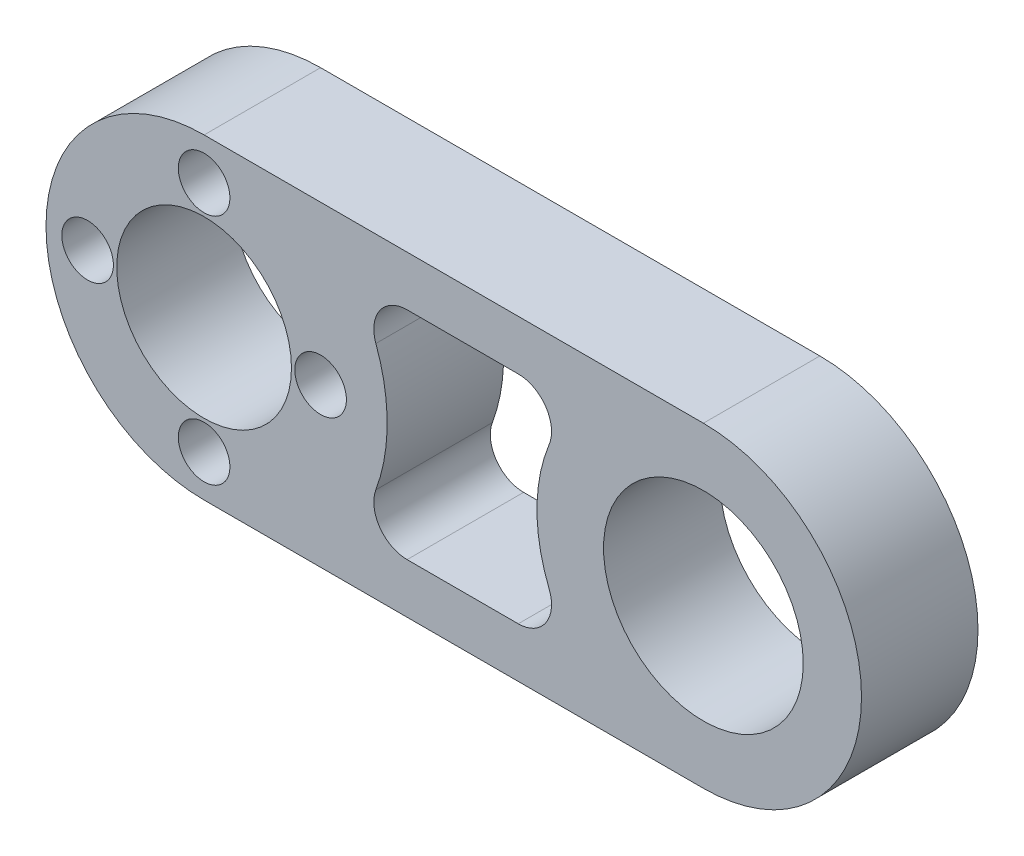
ISO-10303-21;
HEADER;
FILE_DESCRIPTION(('STEP AP214'),'2;1');
FILE_NAME('part.step','',(''),(''),'','','');
FILE_SCHEMA(('AUTOMOTIVE_DESIGN { 1 0 10303 214 1 1 1 1 }'));
ENDSEC;
DATA;
#1=APPLICATION_CONTEXT('core data for automotive mechanical design processes');
#2=APPLICATION_PROTOCOL_DEFINITION('international standard','automotive_design',2000,#1);
#3=PRODUCT_CONTEXT('',#1,'mechanical');
#4=PRODUCT('Part','Part','',(#3));
#5=PRODUCT_RELATED_PRODUCT_CATEGORY('part','',(#4));
#6=PRODUCT_DEFINITION_FORMATION('','',#4);
#7=PRODUCT_DEFINITION_CONTEXT('part definition',#1,'design');
#8=PRODUCT_DEFINITION('design','',#6,#7);
#9=PRODUCT_DEFINITION_SHAPE('','',#8);
#10=(LENGTH_UNIT() NAMED_UNIT(*) SI_UNIT(.MILLI.,.METRE.));
#11=(NAMED_UNIT(*) PLANE_ANGLE_UNIT() SI_UNIT($,.RADIAN.));
#12=(NAMED_UNIT(*) SI_UNIT($,.STERADIAN.) SOLID_ANGLE_UNIT());
#13=UNCERTAINTY_MEASURE_WITH_UNIT(LENGTH_MEASURE(1.E-05),#10,'distance_accuracy_value','');
#14=(GEOMETRIC_REPRESENTATION_CONTEXT(3) GLOBAL_UNCERTAINTY_ASSIGNED_CONTEXT((#13)) GLOBAL_UNIT_ASSIGNED_CONTEXT((#10,
#11,#12)) REPRESENTATION_CONTEXT('',''));
#15=CARTESIAN_POINT('',(0.,0.,0.));
#16=DIRECTION('',(0.,0.,1.));
#17=DIRECTION('',(1.,0.,0.));
#18=AXIS2_PLACEMENT_3D('',#15,#16,#17);
#19=CARTESIAN_POINT('',(0.,0.,7.));
#20=DIRECTION('',(0.,0.,1.));
#21=DIRECTION('',(1.,0.,0.));
#22=AXIS2_PLACEMENT_3D('',#19,#20,#21);
#23=PLANE('',#22);
#24=CARTESIAN_POINT('',(0.,7.,7.));
#25=DIRECTION('',(0.,0.,1.));
#26=DIRECTION('',(1.,0.,0.));
#27=AXIS2_PLACEMENT_3D('',#24,#25,#26);
#28=CIRCLE('',#27,1.55);
#29=CARTESIAN_POINT('',(1.55,7.,7.));
#30=VERTEX_POINT('',#29);
#31=EDGE_CURVE('E225',#30,#30,#28,.T.);
#32=ORIENTED_EDGE('',*,*,#31,.F.);
#33=EDGE_LOOP('',(#32));
#34=FACE_BOUND('',#33,.T.);
#35=CARTESIAN_POINT('',(0.,-7.,7.));
#36=DIRECTION('',(0.,0.,1.));
#37=DIRECTION('',(1.,0.,0.));
#38=AXIS2_PLACEMENT_3D('',#35,#36,#37);
#39=CIRCLE('',#38,1.55);
#40=CARTESIAN_POINT('',(1.55,-7.,7.));
#41=VERTEX_POINT('',#40);
#42=EDGE_CURVE('E237',#41,#41,#39,.T.);
#43=ORIENTED_EDGE('',*,*,#42,.F.);
#44=EDGE_LOOP('',(#43));
#45=FACE_BOUND('',#44,.T.);
#46=CARTESIAN_POINT('',(0.,0.,7.));
#47=DIRECTION('',(0.,0.,1.));
#48=DIRECTION('',(1.,0.,0.));
#49=AXIS2_PLACEMENT_3D('',#46,#47,#48);
#50=CIRCLE('',#49,5.25);
#51=CARTESIAN_POINT('',(5.25,0.,7.));
#52=VERTEX_POINT('',#51);
#53=EDGE_CURVE('E249',#52,#52,#50,.T.);
#54=ORIENTED_EDGE('',*,*,#53,.F.);
#55=EDGE_LOOP('',(#54));
#56=FACE_BOUND('',#55,.T.);
#57=CARTESIAN_POINT('',(0.,0.,7.));
#58=DIRECTION('',(0.,0.,1.));
#59=DIRECTION('',(1.,0.,0.));
#60=AXIS2_PLACEMENT_3D('',#57,#58,#59);
#61=CIRCLE('',#60,9.5);
#62=CARTESIAN_POINT('',(0.,9.5,7.));
#63=VERTEX_POINT('',#62);
#64=CARTESIAN_POINT('',(0.,-9.5,7.));
#65=VERTEX_POINT('',#64);
#66=EDGE_CURVE('E135',#63,#65,#61,.T.);
#67=ORIENTED_EDGE('',*,*,#66,.T.);
#68=DIRECTION('',(1.,0.,0.));
#69=VECTOR('',#68,1.);
#70=CARTESIAN_POINT('',(0.,-9.5,7.));
#71=LINE('',#70,#69);
#72=CARTESIAN_POINT('',(30.,-9.5,7.));
#73=VERTEX_POINT('',#72);
#74=EDGE_CURVE('E124',#65,#73,#71,.T.);
#75=ORIENTED_EDGE('',*,*,#74,.T.);
#76=CARTESIAN_POINT('',(30.,0.,7.));
#77=DIRECTION('',(0.,0.,1.));
#78=DIRECTION('',(1.,0.,0.));
#79=AXIS2_PLACEMENT_3D('',#76,#77,#78);
#80=CIRCLE('',#79,9.5);
#81=CARTESIAN_POINT('',(30.,9.5,7.));
#82=VERTEX_POINT('',#81);
#83=EDGE_CURVE('E134',#73,#82,#80,.T.);
#84=ORIENTED_EDGE('',*,*,#83,.T.);
#85=DIRECTION('',(-1.,0.,0.));
#86=VECTOR('',#85,1.);
#87=CARTESIAN_POINT('',(0.,9.5,7.));
#88=LINE('',#87,#86);
#89=EDGE_CURVE('E140',#82,#63,#88,.T.);
#90=ORIENTED_EDGE('',*,*,#89,.T.);
#91=EDGE_LOOP('',(#67,#75,#84,#90));
#92=FACE_BOUND('',#91,.T.);
#93=CARTESIAN_POINT('',(30.,0.,7.));
#94=DIRECTION('',(0.,0.,1.));
#95=DIRECTION('',(1.,0.,0.));
#96=AXIS2_PLACEMENT_3D('',#93,#94,#95);
#97=CIRCLE('',#96,6.);
#98=CARTESIAN_POINT('',(36.,0.,7.));
#99=VERTEX_POINT('',#98);
#100=EDGE_CURVE('E243',#99,#99,#97,.T.);
#101=ORIENTED_EDGE('',*,*,#100,.F.);
#102=EDGE_LOOP('',(#101));
#103=FACE_BOUND('',#102,.T.);
#104=CARTESIAN_POINT('',(-7.,0.,7.));
#105=DIRECTION('',(0.,0.,1.));
#106=DIRECTION('',(1.,0.,0.));
#107=AXIS2_PLACEMENT_3D('',#104,#105,#106);
#108=CIRCLE('',#107,1.55);
#109=CARTESIAN_POINT('',(-5.45,0.,7.));
#110=VERTEX_POINT('',#109);
#111=EDGE_CURVE('E231',#110,#110,#108,.T.);
#112=ORIENTED_EDGE('',*,*,#111,.F.);
#113=EDGE_LOOP('',(#112));
#114=FACE_BOUND('',#113,.T.);
#115=CARTESIAN_POINT('',(7.,0.,7.));
#116=DIRECTION('',(0.,0.,1.));
#117=DIRECTION('',(1.,0.,0.));
#118=AXIS2_PLACEMENT_3D('',#115,#116,#117);
#119=CIRCLE('',#118,1.55);
#120=CARTESIAN_POINT('',(8.55,0.,7.));
#121=VERTEX_POINT('',#120);
#122=EDGE_CURVE('E209',#121,#121,#119,.T.);
#123=ORIENTED_EDGE('',*,*,#122,.F.);
#124=EDGE_LOOP('',(#123));
#125=FACE_BOUND('',#124,.T.);
#126=DIRECTION('',(-1.,0.,0.));
#127=VECTOR('',#126,1.);
#128=CARTESIAN_POINT('',(22.4006579232147,6.5,7.));
#129=LINE('',#128,#127);
#130=CARTESIAN_POINT('',(18.8757022693565,6.5,7.));
#131=VERTEX_POINT('',#130);
#132=CARTESIAN_POINT('',(12.1963109176505,6.5,7.));
#133=VERTEX_POINT('',#132);
#134=EDGE_CURVE('E212',#131,#133,#129,.T.);
#135=ORIENTED_EDGE('',*,*,#134,.F.);
#136=CARTESIAN_POINT('',(18.8757022693565,4.5,7.));
#137=DIRECTION('',(0.,0.,1.));
#138=DIRECTION('',(1.,0.,0.));
#139=AXIS2_PLACEMENT_3D('',#136,#137,#138);
#140=CIRCLE('',#139,2.);
#141=CARTESIAN_POINT('',(20.7297518911304,3.75,7.));
#142=VERTEX_POINT('',#141);
#143=EDGE_CURVE('E49',#131,#142,#140,.F.);
#144=ORIENTED_EDGE('',*,*,#143,.T.);
#145=CARTESIAN_POINT('',(30.,0.,7.));
#146=DIRECTION('',(0.,0.,-1.));
#147=DIRECTION('',(-1.,0.,0.));
#148=AXIS2_PLACEMENT_3D('',#145,#146,#147);
#149=CIRCLE('',#148,10.);
#150=CARTESIAN_POINT('',(20.7297518911304,-3.75,7.));
#151=VERTEX_POINT('',#150);
#152=EDGE_CURVE('E201',#151,#142,#149,.T.);
#153=ORIENTED_EDGE('',*,*,#152,.F.);
#154=CARTESIAN_POINT('',(18.8757022693565,-4.5,7.));
#155=DIRECTION('',(0.,0.,1.));
#156=DIRECTION('',(1.,0.,0.));
#157=AXIS2_PLACEMENT_3D('',#154,#155,#156);
#158=CIRCLE('',#157,2.);
#159=CARTESIAN_POINT('',(18.8757022693565,-6.5,7.));
#160=VERTEX_POINT('',#159);
#161=EDGE_CURVE('E11',#151,#160,#158,.F.);
#162=ORIENTED_EDGE('',*,*,#161,.T.);
#163=DIRECTION('',(1.,0.,0.));
#164=VECTOR('',#163,1.);
#165=CARTESIAN_POINT('',(22.4006579232147,-6.5,7.));
#166=LINE('',#165,#164);
#167=CARTESIAN_POINT('',(12.1963109176505,-6.5,7.));
#168=VERTEX_POINT('',#167);
#169=EDGE_CURVE('E199',#168,#160,#166,.T.);
#170=ORIENTED_EDGE('',*,*,#169,.F.);
#171=CARTESIAN_POINT('',(12.1963109176505,-4.5,7.));
#172=DIRECTION('',(0.,0.,1.));
#173=DIRECTION('',(1.,0.,0.));
#174=AXIS2_PLACEMENT_3D('',#171,#172,#173);
#175=CIRCLE('',#174,2.);
#176=CARTESIAN_POINT('',(10.3199553918581,-3.80769230769231,7.));
#177=VERTEX_POINT('',#176);
#178=EDGE_CURVE('E179',#168,#177,#175,.F.);
#179=ORIENTED_EDGE('',*,*,#178,.T.);
#180=CARTESIAN_POINT('',(0.,0.,7.));
#181=DIRECTION('',(0.,0.,-1.));
#182=DIRECTION('',(1.,0.,0.));
#183=AXIS2_PLACEMENT_3D('',#180,#181,#182);
#184=CIRCLE('',#183,11.);
#185=CARTESIAN_POINT('',(10.3199553918581,3.80769230769231,7.));
#186=VERTEX_POINT('',#185);
#187=EDGE_CURVE('E206',#186,#177,#184,.T.);
#188=ORIENTED_EDGE('',*,*,#187,.F.);
#189=CARTESIAN_POINT('',(12.1963109176505,4.5,7.));
#190=DIRECTION('',(0.,0.,1.));
#191=DIRECTION('',(1.,0.,0.));
#192=AXIS2_PLACEMENT_3D('',#189,#190,#191);
#193=CIRCLE('',#192,2.);
#194=EDGE_CURVE('E175',#186,#133,#193,.F.);
#195=ORIENTED_EDGE('',*,*,#194,.T.);
#196=EDGE_LOOP('',(#135,#144,#153,#162,#170,#179,#188,#195));
#197=FACE_BOUND('',#196,.T.);
#198=ADVANCED_FACE('F34',(#34,#45,#56,#92,#103,#114,#125,#197),#23,.T.);
#199=CARTESIAN_POINT('',(0.,0.,0.));
#200=DIRECTION('',(0.,0.,1.));
#201=DIRECTION('',(1.,0.,0.));
#202=AXIS2_PLACEMENT_3D('',#199,#200,#201);
#203=PLANE('',#202);
#204=CARTESIAN_POINT('',(7.,0.,0.));
#205=DIRECTION('',(0.,0.,1.));
#206=DIRECTION('',(1.,0.,0.));
#207=AXIS2_PLACEMENT_3D('',#204,#205,#206);
#208=CIRCLE('',#207,1.55);
#209=CARTESIAN_POINT('',(8.55,0.,0.));
#210=VERTEX_POINT('',#209);
#211=EDGE_CURVE('E205',#210,#210,#208,.T.);
#212=ORIENTED_EDGE('',*,*,#211,.T.);
#213=EDGE_LOOP('',(#212));
#214=FACE_BOUND('',#213,.T.);
#215=CARTESIAN_POINT('',(0.,7.,0.));
#216=DIRECTION('',(0.,0.,1.));
#217=DIRECTION('',(1.,0.,0.));
#218=AXIS2_PLACEMENT_3D('',#215,#216,#217);
#219=CIRCLE('',#218,1.55);
#220=CARTESIAN_POINT('',(1.55,7.,0.));
#221=VERTEX_POINT('',#220);
#222=EDGE_CURVE('E223',#221,#221,#219,.T.);
#223=ORIENTED_EDGE('',*,*,#222,.T.);
#224=EDGE_LOOP('',(#223));
#225=FACE_BOUND('',#224,.T.);
#226=CARTESIAN_POINT('',(-7.,0.,0.));
#227=DIRECTION('',(0.,0.,1.));
#228=DIRECTION('',(1.,0.,0.));
#229=AXIS2_PLACEMENT_3D('',#226,#227,#228);
#230=CIRCLE('',#229,1.55);
#231=CARTESIAN_POINT('',(-5.45,0.,0.));
#232=VERTEX_POINT('',#231);
#233=EDGE_CURVE('E228',#232,#232,#230,.T.);
#234=ORIENTED_EDGE('',*,*,#233,.T.);
#235=EDGE_LOOP('',(#234));
#236=FACE_BOUND('',#235,.T.);
#237=CARTESIAN_POINT('',(0.,-7.,0.));
#238=DIRECTION('',(0.,0.,1.));
#239=DIRECTION('',(1.,0.,0.));
#240=AXIS2_PLACEMENT_3D('',#237,#238,#239);
#241=CIRCLE('',#240,1.55);
#242=CARTESIAN_POINT('',(1.55,-7.,0.));
#243=VERTEX_POINT('',#242);
#244=EDGE_CURVE('E234',#243,#243,#241,.T.);
#245=ORIENTED_EDGE('',*,*,#244,.T.);
#246=EDGE_LOOP('',(#245));
#247=FACE_BOUND('',#246,.T.);
#248=CARTESIAN_POINT('',(30.,0.,0.));
#249=DIRECTION('',(0.,0.,1.));
#250=DIRECTION('',(1.,0.,0.));
#251=AXIS2_PLACEMENT_3D('',#248,#249,#250);
#252=CIRCLE('',#251,6.);
#253=CARTESIAN_POINT('',(36.,0.,0.));
#254=VERTEX_POINT('',#253);
#255=EDGE_CURVE('E240',#254,#254,#252,.T.);
#256=ORIENTED_EDGE('',*,*,#255,.T.);
#257=EDGE_LOOP('',(#256));
#258=FACE_BOUND('',#257,.T.);
#259=CARTESIAN_POINT('',(0.,0.,0.));
#260=DIRECTION('',(0.,0.,1.));
#261=DIRECTION('',(1.,0.,0.));
#262=AXIS2_PLACEMENT_3D('',#259,#260,#261);
#263=CIRCLE('',#262,5.25);
#264=CARTESIAN_POINT('',(5.25,0.,0.));
#265=VERTEX_POINT('',#264);
#266=EDGE_CURVE('E246',#265,#265,#263,.T.);
#267=ORIENTED_EDGE('',*,*,#266,.T.);
#268=EDGE_LOOP('',(#267));
#269=FACE_BOUND('',#268,.T.);
#270=CARTESIAN_POINT('',(0.,0.,0.));
#271=DIRECTION('',(0.,0.,1.));
#272=DIRECTION('',(1.,0.,0.));
#273=AXIS2_PLACEMENT_3D('',#270,#271,#272);
#274=CIRCLE('',#273,9.5);
#275=CARTESIAN_POINT('',(0.,9.5,0.));
#276=VERTEX_POINT('',#275);
#277=CARTESIAN_POINT('',(0.,-9.5,0.));
#278=VERTEX_POINT('',#277);
#279=EDGE_CURVE('E148',#276,#278,#274,.T.);
#280=ORIENTED_EDGE('',*,*,#279,.F.);
#281=DIRECTION('',(-1.,0.,0.));
#282=VECTOR('',#281,1.);
#283=CARTESIAN_POINT('',(0.,9.5,0.));
#284=LINE('',#283,#282);
#285=CARTESIAN_POINT('',(30.,9.5,0.));
#286=VERTEX_POINT('',#285);
#287=EDGE_CURVE('E144',#286,#276,#284,.T.);
#288=ORIENTED_EDGE('',*,*,#287,.F.);
#289=CARTESIAN_POINT('',(30.,0.,0.));
#290=DIRECTION('',(0.,0.,1.));
#291=DIRECTION('',(1.,0.,0.));
#292=AXIS2_PLACEMENT_3D('',#289,#290,#291);
#293=CIRCLE('',#292,9.5);
#294=CARTESIAN_POINT('',(30.,-9.5,0.));
#295=VERTEX_POINT('',#294);
#296=EDGE_CURVE('E260',#295,#286,#293,.T.);
#297=ORIENTED_EDGE('',*,*,#296,.F.);
#298=DIRECTION('',(1.,0.,0.));
#299=VECTOR('',#298,1.);
#300=CARTESIAN_POINT('',(0.,-9.5,0.));
#301=LINE('',#300,#299);
#302=EDGE_CURVE('E258',#278,#295,#301,.T.);
#303=ORIENTED_EDGE('',*,*,#302,.F.);
#304=EDGE_LOOP('',(#280,#288,#297,#303));
#305=FACE_BOUND('',#304,.T.);
#306=DIRECTION('',(1.,0.,0.));
#307=VECTOR('',#306,1.);
#308=CARTESIAN_POINT('',(22.4006579232147,-6.5,0.));
#309=LINE('',#308,#307);
#310=CARTESIAN_POINT('',(12.1963109176505,-6.5,0.));
#311=VERTEX_POINT('',#310);
#312=CARTESIAN_POINT('',(18.8757022693565,-6.5,0.));
#313=VERTEX_POINT('',#312);
#314=EDGE_CURVE('E189',#311,#313,#309,.T.);
#315=ORIENTED_EDGE('',*,*,#314,.T.);
#316=CARTESIAN_POINT('',(18.8757022693565,-4.5,0.));
#317=DIRECTION('',(0.,0.,1.));
#318=DIRECTION('',(1.,0.,0.));
#319=AXIS2_PLACEMENT_3D('',#316,#317,#318);
#320=CIRCLE('',#319,2.);
#321=CARTESIAN_POINT('',(20.7297518911304,-3.75,0.));
#322=VERTEX_POINT('',#321);
#323=EDGE_CURVE('E42',#313,#322,#320,.T.);
#324=ORIENTED_EDGE('',*,*,#323,.T.);
#325=CARTESIAN_POINT('',(30.,0.,0.));
#326=DIRECTION('',(0.,0.,-1.));
#327=DIRECTION('',(-1.,0.,0.));
#328=AXIS2_PLACEMENT_3D('',#325,#326,#327);
#329=CIRCLE('',#328,10.);
#330=CARTESIAN_POINT('',(20.7297518911304,3.75,0.));
#331=VERTEX_POINT('',#330);
#332=EDGE_CURVE('E187',#322,#331,#329,.T.);
#333=ORIENTED_EDGE('',*,*,#332,.T.);
#334=CARTESIAN_POINT('',(18.8757022693565,4.5,0.));
#335=DIRECTION('',(0.,0.,1.));
#336=DIRECTION('',(1.,0.,0.));
#337=AXIS2_PLACEMENT_3D('',#334,#335,#336);
#338=CIRCLE('',#337,2.);
#339=CARTESIAN_POINT('',(18.8757022693565,6.5,0.));
#340=VERTEX_POINT('',#339);
#341=EDGE_CURVE('E181',#331,#340,#338,.T.);
#342=ORIENTED_EDGE('',*,*,#341,.T.);
#343=DIRECTION('',(-1.,0.,0.));
#344=VECTOR('',#343,1.);
#345=CARTESIAN_POINT('',(22.4006579232147,6.5,0.));
#346=LINE('',#345,#344);
#347=CARTESIAN_POINT('',(12.1963109176505,6.5,0.));
#348=VERTEX_POINT('',#347);
#349=EDGE_CURVE('E194',#340,#348,#346,.T.);
#350=ORIENTED_EDGE('',*,*,#349,.T.);
#351=CARTESIAN_POINT('',(12.1963109176505,4.5,0.));
#352=DIRECTION('',(0.,0.,1.));
#353=DIRECTION('',(1.,0.,0.));
#354=AXIS2_PLACEMENT_3D('',#351,#352,#353);
#355=CIRCLE('',#354,2.);
#356=CARTESIAN_POINT('',(10.3199553918581,3.80769230769231,0.));
#357=VERTEX_POINT('',#356);
#358=EDGE_CURVE('E173',#348,#357,#355,.T.);
#359=ORIENTED_EDGE('',*,*,#358,.T.);
#360=CARTESIAN_POINT('',(0.,0.,0.));
#361=DIRECTION('',(0.,0.,-1.));
#362=DIRECTION('',(1.,0.,0.));
#363=AXIS2_PLACEMENT_3D('',#360,#361,#362);
#364=CIRCLE('',#363,11.);
#365=CARTESIAN_POINT('',(10.3199553918581,-3.80769230769231,0.));
#366=VERTEX_POINT('',#365);
#367=EDGE_CURVE('E218',#357,#366,#364,.T.);
#368=ORIENTED_EDGE('',*,*,#367,.T.);
#369=CARTESIAN_POINT('',(12.1963109176505,-4.5,0.));
#370=DIRECTION('',(0.,0.,1.));
#371=DIRECTION('',(1.,0.,0.));
#372=AXIS2_PLACEMENT_3D('',#369,#370,#371);
#373=CIRCLE('',#372,2.);
#374=EDGE_CURVE('E177',#366,#311,#373,.T.);
#375=ORIENTED_EDGE('',*,*,#374,.T.);
#376=EDGE_LOOP('',(#315,#324,#333,#342,#350,#359,#368,#375));
#377=FACE_BOUND('',#376,.T.);
#378=ADVANCED_FACE('F186',(#214,#225,#236,#247,#258,#269,#305,#377),#203,.F.);
#379=CARTESIAN_POINT('',(0.,0.,7.));
#380=DIRECTION('',(0.,0.,-1.));
#381=DIRECTION('',(-1.,0.,0.));
#382=AXIS2_PLACEMENT_3D('',#379,#380,#381);
#383=CYLINDRICAL_SURFACE('',#382,9.5);
#384=ORIENTED_EDGE('',*,*,#279,.T.);
#385=DIRECTION('',(0.,0.,-1.));
#386=VECTOR('',#385,1.);
#387=CARTESIAN_POINT('',(0.,-9.5,7.));
#388=LINE('',#387,#386);
#389=EDGE_CURVE('E128',#65,#278,#388,.T.);
#390=ORIENTED_EDGE('',*,*,#389,.F.);
#391=ORIENTED_EDGE('',*,*,#66,.F.);
#392=DIRECTION('',(0.,0.,-1.));
#393=VECTOR('',#392,1.);
#394=CARTESIAN_POINT('',(0.,9.5,7.));
#395=LINE('',#394,#393);
#396=EDGE_CURVE('E256',#63,#276,#395,.T.);
#397=ORIENTED_EDGE('',*,*,#396,.T.);
#398=EDGE_LOOP('',(#384,#390,#391,#397));
#399=FACE_BOUND('',#398,.T.);
#400=ADVANCED_FACE('F146',(#399),#383,.T.);
#401=CARTESIAN_POINT('',(0.,-9.5,7.));
#402=DIRECTION('',(0.,1.,0.));
#403=DIRECTION('',(0.,0.,1.));
#404=AXIS2_PLACEMENT_3D('',#401,#402,#403);
#405=PLANE('',#404);
#406=ORIENTED_EDGE('',*,*,#302,.T.);
#407=DIRECTION('',(0.,0.,-1.));
#408=VECTOR('',#407,1.);
#409=CARTESIAN_POINT('',(30.,-9.5,7.));
#410=LINE('',#409,#408);
#411=EDGE_CURVE('E131',#73,#295,#410,.T.);
#412=ORIENTED_EDGE('',*,*,#411,.F.);
#413=ORIENTED_EDGE('',*,*,#74,.F.);
#414=ORIENTED_EDGE('',*,*,#389,.T.);
#415=EDGE_LOOP('',(#406,#412,#413,#414));
#416=FACE_BOUND('',#415,.T.);
#417=ADVANCED_FACE('F126',(#416),#405,.F.);
#418=CARTESIAN_POINT('',(30.,0.,7.));
#419=DIRECTION('',(0.,0.,-1.));
#420=DIRECTION('',(-1.,0.,0.));
#421=AXIS2_PLACEMENT_3D('',#418,#419,#420);
#422=CYLINDRICAL_SURFACE('',#421,9.5);
#423=ORIENTED_EDGE('',*,*,#296,.T.);
#424=DIRECTION('',(0.,0.,-1.));
#425=VECTOR('',#424,1.);
#426=CARTESIAN_POINT('',(30.,9.5,7.));
#427=LINE('',#426,#425);
#428=EDGE_CURVE('E153',#82,#286,#427,.T.);
#429=ORIENTED_EDGE('',*,*,#428,.F.);
#430=ORIENTED_EDGE('',*,*,#83,.F.);
#431=ORIENTED_EDGE('',*,*,#411,.T.);
#432=EDGE_LOOP('',(#423,#429,#430,#431));
#433=FACE_BOUND('',#432,.T.);
#434=ADVANCED_FACE('F271',(#433),#422,.T.);
#435=CARTESIAN_POINT('',(0.,9.5,7.));
#436=DIRECTION('',(0.,-1.,0.));
#437=DIRECTION('',(0.,0.,-1.));
#438=AXIS2_PLACEMENT_3D('',#435,#436,#437);
#439=PLANE('',#438);
#440=ORIENTED_EDGE('',*,*,#287,.T.);
#441=ORIENTED_EDGE('',*,*,#396,.F.);
#442=ORIENTED_EDGE('',*,*,#89,.F.);
#443=ORIENTED_EDGE('',*,*,#428,.T.);
#444=EDGE_LOOP('',(#440,#441,#442,#443));
#445=FACE_BOUND('',#444,.T.);
#446=ADVANCED_FACE('F267',(#445),#439,.F.);
#447=CARTESIAN_POINT('',(0.,0.,7.));
#448=DIRECTION('',(0.,0.,-1.));
#449=DIRECTION('',(-1.,0.,0.));
#450=AXIS2_PLACEMENT_3D('',#447,#448,#449);
#451=CYLINDRICAL_SURFACE('',#450,5.25);
#452=ORIENTED_EDGE('',*,*,#53,.T.);
#453=EDGE_LOOP('',(#452));
#454=FACE_BOUND('',#453,.T.);
#455=ORIENTED_EDGE('',*,*,#266,.F.);
#456=EDGE_LOOP('',(#455));
#457=FACE_BOUND('',#456,.T.);
#458=ADVANCED_FACE('F278',(#454,#457),#451,.F.);
#459=CARTESIAN_POINT('',(30.,0.,7.));
#460=DIRECTION('',(0.,0.,-1.));
#461=DIRECTION('',(-1.,0.,0.));
#462=AXIS2_PLACEMENT_3D('',#459,#460,#461);
#463=CYLINDRICAL_SURFACE('',#462,6.);
#464=ORIENTED_EDGE('',*,*,#100,.T.);
#465=EDGE_LOOP('',(#464));
#466=FACE_BOUND('',#465,.T.);
#467=ORIENTED_EDGE('',*,*,#255,.F.);
#468=EDGE_LOOP('',(#467));
#469=FACE_BOUND('',#468,.T.);
#470=ADVANCED_FACE('F294',(#466,#469),#463,.F.);
#471=CARTESIAN_POINT('',(0.,-7.,7.));
#472=DIRECTION('',(0.,0.,-1.));
#473=DIRECTION('',(-1.,0.,0.));
#474=AXIS2_PLACEMENT_3D('',#471,#472,#473);
#475=CYLINDRICAL_SURFACE('',#474,1.55);
#476=ORIENTED_EDGE('',*,*,#42,.T.);
#477=EDGE_LOOP('',(#476));
#478=FACE_BOUND('',#477,.T.);
#479=ORIENTED_EDGE('',*,*,#244,.F.);
#480=EDGE_LOOP('',(#479));
#481=FACE_BOUND('',#480,.T.);
#482=ADVANCED_FACE('F298',(#478,#481),#475,.F.);
#483=CARTESIAN_POINT('',(-7.,0.,7.));
#484=DIRECTION('',(0.,0.,-1.));
#485=DIRECTION('',(-1.,0.,0.));
#486=AXIS2_PLACEMENT_3D('',#483,#484,#485);
#487=CYLINDRICAL_SURFACE('',#486,1.55);
#488=ORIENTED_EDGE('',*,*,#111,.T.);
#489=EDGE_LOOP('',(#488));
#490=FACE_BOUND('',#489,.T.);
#491=ORIENTED_EDGE('',*,*,#233,.F.);
#492=EDGE_LOOP('',(#491));
#493=FACE_BOUND('',#492,.T.);
#494=ADVANCED_FACE('F302',(#490,#493),#487,.F.);
#495=CARTESIAN_POINT('',(0.,7.,7.));
#496=DIRECTION('',(0.,0.,-1.));
#497=DIRECTION('',(-1.,0.,0.));
#498=AXIS2_PLACEMENT_3D('',#495,#496,#497);
#499=CYLINDRICAL_SURFACE('',#498,1.55);
#500=ORIENTED_EDGE('',*,*,#31,.T.);
#501=EDGE_LOOP('',(#500));
#502=FACE_BOUND('',#501,.T.);
#503=ORIENTED_EDGE('',*,*,#222,.F.);
#504=EDGE_LOOP('',(#503));
#505=FACE_BOUND('',#504,.T.);
#506=ADVANCED_FACE('F306',(#502,#505),#499,.F.);
#507=CARTESIAN_POINT('',(7.,0.,7.));
#508=DIRECTION('',(0.,0.,-1.));
#509=DIRECTION('',(-1.,0.,0.));
#510=AXIS2_PLACEMENT_3D('',#507,#508,#509);
#511=CYLINDRICAL_SURFACE('',#510,1.55);
#512=ORIENTED_EDGE('',*,*,#122,.T.);
#513=EDGE_LOOP('',(#512));
#514=FACE_BOUND('',#513,.T.);
#515=ORIENTED_EDGE('',*,*,#211,.F.);
#516=EDGE_LOOP('',(#515));
#517=FACE_BOUND('',#516,.T.);
#518=ADVANCED_FACE('F310',(#514,#517),#511,.F.);
#519=CARTESIAN_POINT('',(30.,0.,7.));
#520=DIRECTION('',(0.,0.,-1.));
#521=DIRECTION('',(-1.,0.,0.));
#522=AXIS2_PLACEMENT_3D('',#519,#520,#521);
#523=CYLINDRICAL_SURFACE('',#522,10.);
#524=ORIENTED_EDGE('',*,*,#152,.T.);
#525=DIRECTION('',(0.,0.,-1.));
#526=VECTOR('',#525,1.);
#527=CARTESIAN_POINT('',(20.7297518911304,3.75,7.));
#528=LINE('',#527,#526);
#529=EDGE_CURVE('E170',#142,#331,#528,.T.);
#530=ORIENTED_EDGE('',*,*,#529,.T.);
#531=ORIENTED_EDGE('',*,*,#332,.F.);
#532=DIRECTION('',(0.,0.,-1.));
#533=VECTOR('',#532,1.);
#534=CARTESIAN_POINT('',(20.7297518911304,-3.75,7.));
#535=LINE('',#534,#533);
#536=EDGE_CURVE('E56',#322,#151,#535,.F.);
#537=ORIENTED_EDGE('',*,*,#536,.T.);
#538=EDGE_LOOP('',(#524,#530,#531,#537));
#539=FACE_BOUND('',#538,.T.);
#540=ADVANCED_FACE('F192',(#539),#523,.T.);
#541=CARTESIAN_POINT('',(22.4006579232147,6.5,7.));
#542=DIRECTION('',(0.,-1.,0.));
#543=DIRECTION('',(0.,0.,-1.));
#544=AXIS2_PLACEMENT_3D('',#541,#542,#543);
#545=PLANE('',#544);
#546=ORIENTED_EDGE('',*,*,#134,.T.);
#547=DIRECTION('',(0.,0.,1.));
#548=VECTOR('',#547,1.);
#549=CARTESIAN_POINT('',(12.1963109176505,6.5,0.));
#550=LINE('',#549,#548);
#551=EDGE_CURVE('E151',#133,#348,#550,.F.);
#552=ORIENTED_EDGE('',*,*,#551,.T.);
#553=ORIENTED_EDGE('',*,*,#349,.F.);
#554=DIRECTION('',(0.,0.,1.));
#555=VECTOR('',#554,1.);
#556=CARTESIAN_POINT('',(18.8757022693565,6.5,7.));
#557=LINE('',#556,#555);
#558=EDGE_CURVE('E149',#340,#131,#557,.T.);
#559=ORIENTED_EDGE('',*,*,#558,.T.);
#560=EDGE_LOOP('',(#546,#552,#553,#559));
#561=FACE_BOUND('',#560,.T.);
#562=ADVANCED_FACE('F317',(#561),#545,.T.);
#563=CARTESIAN_POINT('',(0.,0.,7.));
#564=DIRECTION('',(0.,0.,-1.));
#565=DIRECTION('',(-1.,0.,0.));
#566=AXIS2_PLACEMENT_3D('',#563,#564,#565);
#567=CYLINDRICAL_SURFACE('',#566,11.);
#568=ORIENTED_EDGE('',*,*,#367,.F.);
#569=DIRECTION('',(0.,0.,-1.));
#570=VECTOR('',#569,1.);
#571=CARTESIAN_POINT('',(10.3199553918581,3.80769230769231,7.));
#572=LINE('',#571,#570);
#573=EDGE_CURVE('E162',#357,#186,#572,.F.);
#574=ORIENTED_EDGE('',*,*,#573,.T.);
#575=ORIENTED_EDGE('',*,*,#187,.T.);
#576=DIRECTION('',(0.,0.,-1.));
#577=VECTOR('',#576,1.);
#578=CARTESIAN_POINT('',(10.3199553918581,-3.80769230769231,7.));
#579=LINE('',#578,#577);
#580=EDGE_CURVE('E159',#177,#366,#579,.T.);
#581=ORIENTED_EDGE('',*,*,#580,.T.);
#582=EDGE_LOOP('',(#568,#574,#575,#581));
#583=FACE_BOUND('',#582,.T.);
#584=ADVANCED_FACE('F320',(#583),#567,.T.);
#585=CARTESIAN_POINT('',(22.4006579232147,-6.5,7.));
#586=DIRECTION('',(0.,1.,0.));
#587=DIRECTION('',(0.,0.,1.));
#588=AXIS2_PLACEMENT_3D('',#585,#586,#587);
#589=PLANE('',#588);
#590=ORIENTED_EDGE('',*,*,#314,.F.);
#591=DIRECTION('',(0.,0.,1.));
#592=VECTOR('',#591,1.);
#593=CARTESIAN_POINT('',(12.1963109176505,-6.5,7.));
#594=LINE('',#593,#592);
#595=EDGE_CURVE('E167',#311,#168,#594,.T.);
#596=ORIENTED_EDGE('',*,*,#595,.T.);
#597=ORIENTED_EDGE('',*,*,#169,.T.);
#598=DIRECTION('',(0.,0.,1.));
#599=VECTOR('',#598,1.);
#600=CARTESIAN_POINT('',(18.8757022693565,-6.5,0.));
#601=LINE('',#600,#599);
#602=EDGE_CURVE('E164',#160,#313,#601,.F.);
#603=ORIENTED_EDGE('',*,*,#602,.T.);
#604=EDGE_LOOP('',(#590,#596,#597,#603));
#605=FACE_BOUND('',#604,.T.);
#606=ADVANCED_FACE('F203',(#605),#589,.T.);
#607=CARTESIAN_POINT('',(12.1963109176505,4.5,7.));
#608=DIRECTION('',(0.,0.,-1.));
#609=DIRECTION('',(-1.,0.,0.));
#610=AXIS2_PLACEMENT_3D('',#607,#608,#609);
#611=CYLINDRICAL_SURFACE('',#610,2.);
#612=ORIENTED_EDGE('',*,*,#194,.F.);
#613=ORIENTED_EDGE('',*,*,#573,.F.);
#614=ORIENTED_EDGE('',*,*,#358,.F.);
#615=ORIENTED_EDGE('',*,*,#551,.F.);
#616=EDGE_LOOP('',(#612,#613,#614,#615));
#617=FACE_BOUND('',#616,.T.);
#618=ADVANCED_FACE('F326',(#617),#611,.F.);
#619=CARTESIAN_POINT('',(12.1963109176505,-4.5,7.));
#620=DIRECTION('',(0.,0.,-1.));
#621=DIRECTION('',(-1.,0.,0.));
#622=AXIS2_PLACEMENT_3D('',#619,#620,#621);
#623=CYLINDRICAL_SURFACE('',#622,2.);
#624=ORIENTED_EDGE('',*,*,#178,.F.);
#625=ORIENTED_EDGE('',*,*,#595,.F.);
#626=ORIENTED_EDGE('',*,*,#374,.F.);
#627=ORIENTED_EDGE('',*,*,#580,.F.);
#628=EDGE_LOOP('',(#624,#625,#626,#627));
#629=FACE_BOUND('',#628,.T.);
#630=ADVANCED_FACE('F330',(#629),#623,.F.);
#631=CARTESIAN_POINT('',(18.8757022693565,4.5,7.));
#632=DIRECTION('',(0.,0.,-1.));
#633=DIRECTION('',(-1.,0.,0.));
#634=AXIS2_PLACEMENT_3D('',#631,#632,#633);
#635=CYLINDRICAL_SURFACE('',#634,2.);
#636=ORIENTED_EDGE('',*,*,#143,.F.);
#637=ORIENTED_EDGE('',*,*,#558,.F.);
#638=ORIENTED_EDGE('',*,*,#341,.F.);
#639=ORIENTED_EDGE('',*,*,#529,.F.);
#640=EDGE_LOOP('',(#636,#637,#638,#639));
#641=FACE_BOUND('',#640,.T.);
#642=ADVANCED_FACE('F336',(#641),#635,.F.);
#643=CARTESIAN_POINT('',(18.8757022693565,-4.5,7.));
#644=DIRECTION('',(0.,0.,-1.));
#645=DIRECTION('',(-1.,0.,0.));
#646=AXIS2_PLACEMENT_3D('',#643,#644,#645);
#647=CYLINDRICAL_SURFACE('',#646,2.);
#648=ORIENTED_EDGE('',*,*,#161,.F.);
#649=ORIENTED_EDGE('',*,*,#536,.F.);
#650=ORIENTED_EDGE('',*,*,#323,.F.);
#651=ORIENTED_EDGE('',*,*,#602,.F.);
#652=EDGE_LOOP('',(#648,#649,#650,#651));
#653=FACE_BOUND('',#652,.T.);
#654=ADVANCED_FACE('F36',(#653),#647,.F.);
#655=CLOSED_SHELL('',(#198,#378,#400,#417,#434,#446,#458,#470,#482,#494,#506,#518,#540,#562,
#584,#606,#618,#630,#642,#654));
#656=MANIFOLD_SOLID_BREP('B2',#655);
#657=ADVANCED_BREP_SHAPE_REPRESENTATION('',(#18,#656),#14);
#658=SHAPE_DEFINITION_REPRESENTATION(#9,#657);
ENDSEC;
END-ISO-10303-21;
